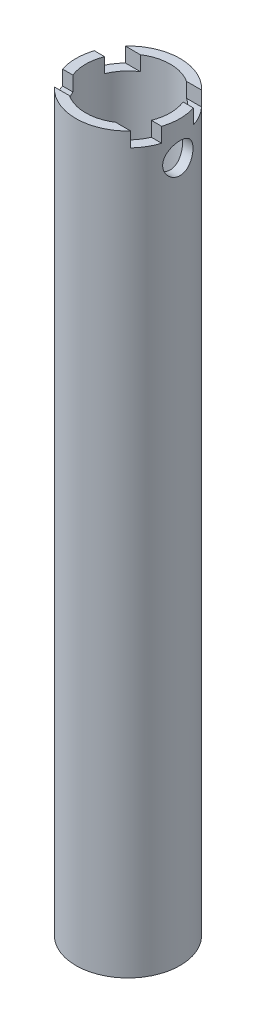
ISO-10303-21;
HEADER;
FILE_DESCRIPTION(('STEP AP214'),'2;1');
FILE_NAME('part.step','',(''),(''),'','','');
FILE_SCHEMA(('AUTOMOTIVE_DESIGN { 1 0 10303 214 1 1 1 1 }'));
ENDSEC;
DATA;
#1=APPLICATION_CONTEXT('core data for automotive mechanical design processes');
#2=APPLICATION_PROTOCOL_DEFINITION('international standard','automotive_design',2000,#1);
#3=PRODUCT_CONTEXT('',#1,'mechanical');
#4=PRODUCT('Part','Part','',(#3));
#5=PRODUCT_RELATED_PRODUCT_CATEGORY('part','',(#4));
#6=PRODUCT_DEFINITION_FORMATION('','',#4);
#7=PRODUCT_DEFINITION_CONTEXT('part definition',#1,'design');
#8=PRODUCT_DEFINITION('design','',#6,#7);
#9=PRODUCT_DEFINITION_SHAPE('','',#8);
#10=(LENGTH_UNIT() NAMED_UNIT(*) SI_UNIT(.MILLI.,.METRE.));
#11=(NAMED_UNIT(*) PLANE_ANGLE_UNIT() SI_UNIT($,.RADIAN.));
#12=(NAMED_UNIT(*) SI_UNIT($,.STERADIAN.) SOLID_ANGLE_UNIT());
#13=UNCERTAINTY_MEASURE_WITH_UNIT(LENGTH_MEASURE(1.E-05),#10,'distance_accuracy_value','');
#14=(GEOMETRIC_REPRESENTATION_CONTEXT(3) GLOBAL_UNCERTAINTY_ASSIGNED_CONTEXT((#13)) GLOBAL_UNIT_ASSIGNED_CONTEXT((#10,
#11,#12)) REPRESENTATION_CONTEXT('',''));
#15=CARTESIAN_POINT('',(0.,0.,0.));
#16=DIRECTION('',(0.,0.,1.));
#17=DIRECTION('',(1.,0.,0.));
#18=AXIS2_PLACEMENT_3D('',#15,#16,#17);
#19=CARTESIAN_POINT('',(0.,0.,0.));
#20=DIRECTION('',(0.,1.,0.));
#21=DIRECTION('',(0.,0.,1.));
#22=AXIS2_PLACEMENT_3D('',#19,#20,#21);
#23=PLANE('',#22);
#24=CARTESIAN_POINT('',(0.,0.,0.));
#25=DIRECTION('',(0.,1.,0.));
#26=DIRECTION('',(0.,0.,1.));
#27=AXIS2_PLACEMENT_3D('',#24,#25,#26);
#28=CIRCLE('',#27,10.65);
#29=CARTESIAN_POINT('',(10.1419919148065,0.,3.25));
#30=VERTEX_POINT('',#29);
#31=CARTESIAN_POINT('',(10.1419919148065,0.,-3.25));
#32=VERTEX_POINT('',#31);
#33=EDGE_CURVE('E289',#30,#32,#28,.T.);
#34=ORIENTED_EDGE('',*,*,#33,.T.);
#35=DIRECTION('',(-1.,0.,0.));
#36=VECTOR('',#35,1.);
#37=CARTESIAN_POINT('',(0.,0.,-3.25));
#38=LINE('',#37,#36);
#39=CARTESIAN_POINT('',(8.01623352953244,0.,-3.25));
#40=VERTEX_POINT('',#39);
#41=EDGE_CURVE('E160',#32,#40,#38,.T.);
#42=ORIENTED_EDGE('',*,*,#41,.T.);
#43=CARTESIAN_POINT('',(0.,0.,0.));
#44=DIRECTION('',(0.,1.,0.));
#45=DIRECTION('',(0.,0.,1.));
#46=AXIS2_PLACEMENT_3D('',#43,#44,#45);
#47=CIRCLE('',#46,8.65);
#48=CARTESIAN_POINT('',(8.01623352953244,0.,3.25));
#49=VERTEX_POINT('',#48);
#50=EDGE_CURVE('E284',#49,#40,#47,.T.);
#51=ORIENTED_EDGE('',*,*,#50,.F.);
#52=DIRECTION('',(1.,0.,0.));
#53=VECTOR('',#52,1.);
#54=CARTESIAN_POINT('',(0.,0.,3.25));
#55=LINE('',#54,#53);
#56=EDGE_CURVE('E204',#49,#30,#55,.T.);
#57=ORIENTED_EDGE('',*,*,#56,.T.);
#58=EDGE_LOOP('',(#34,#42,#51,#57));
#59=FACE_BOUND('',#58,.T.);
#60=ADVANCED_FACE('F40',(#59),#23,.T.);
#61=CARTESIAN_POINT('',(-8.01623352953244,0.,-3.25));
#62=VERTEX_POINT('',#61);
#63=CARTESIAN_POINT('',(-8.01623352953244,0.,3.25));
#64=VERTEX_POINT('',#63);
#65=EDGE_CURVE('E285',#62,#64,#47,.T.);
#66=ORIENTED_EDGE('',*,*,#65,.F.);
#67=CARTESIAN_POINT('',(-10.1419919148065,0.,-3.25));
#68=VERTEX_POINT('',#67);
#69=EDGE_CURVE('E176',#62,#68,#38,.T.);
#70=ORIENTED_EDGE('',*,*,#69,.T.);
#71=CARTESIAN_POINT('',(-10.1419919148065,0.,3.25));
#72=VERTEX_POINT('',#71);
#73=EDGE_CURVE('E174',#68,#72,#28,.T.);
#74=ORIENTED_EDGE('',*,*,#73,.T.);
#75=EDGE_CURVE('E200',#72,#64,#55,.T.);
#76=ORIENTED_EDGE('',*,*,#75,.T.);
#77=EDGE_LOOP('',(#66,#70,#74,#76));
#78=FACE_BOUND('',#77,.T.);
#79=ADVANCED_FACE('F317',(#78),#23,.T.);
#80=DIRECTION('',(-1.,0.,0.));
#81=VECTOR('',#80,1.);
#82=CARTESIAN_POINT('',(0.,0.,-7.25));
#83=LINE('',#82,#81);
#84=CARTESIAN_POINT('',(7.80128194593683,0.,-7.25));
#85=VERTEX_POINT('',#84);
#86=CARTESIAN_POINT('',(4.71805044483418,0.,-7.25));
#87=VERTEX_POINT('',#86);
#88=EDGE_CURVE('E175',#85,#87,#83,.T.);
#89=ORIENTED_EDGE('',*,*,#88,.F.);
#90=CARTESIAN_POINT('',(-7.80128194593683,0.,-7.25));
#91=VERTEX_POINT('',#90);
#92=EDGE_CURVE('E293',#85,#91,#28,.T.);
#93=ORIENTED_EDGE('',*,*,#92,.T.);
#94=CARTESIAN_POINT('',(-4.71805044483418,0.,-7.25));
#95=VERTEX_POINT('',#94);
#96=EDGE_CURVE('E180',#95,#91,#83,.T.);
#97=ORIENTED_EDGE('',*,*,#96,.F.);
#98=EDGE_CURVE('E280',#87,#95,#47,.T.);
#99=ORIENTED_EDGE('',*,*,#98,.F.);
#100=EDGE_LOOP('',(#89,#93,#97,#99));
#101=FACE_BOUND('',#100,.T.);
#102=ADVANCED_FACE('F315',(#101),#23,.T.);
#103=CARTESIAN_POINT('',(0.,-150.,0.));
#104=DIRECTION('',(0.,1.,0.));
#105=DIRECTION('',(0.,0.,1.));
#106=AXIS2_PLACEMENT_3D('',#103,#104,#105);
#107=CYLINDRICAL_SURFACE('',#106,10.65);
#108=DIRECTION('',(0.,1.,0.));
#109=VECTOR('',#108,1.);
#110=CARTESIAN_POINT('',(-7.80128194593683,-150.,-7.25));
#111=LINE('',#110,#109);
#112=CARTESIAN_POINT('',(-7.80128194593683,-3.,-7.25));
#113=VERTEX_POINT('',#112);
#114=EDGE_CURVE('E186',#91,#113,#111,.F.);
#115=ORIENTED_EDGE('',*,*,#114,.F.);
#116=ORIENTED_EDGE('',*,*,#92,.F.);
#117=DIRECTION('',(0.,1.,0.));
#118=VECTOR('',#117,1.);
#119=CARTESIAN_POINT('',(7.80128194593683,-150.,-7.25));
#120=LINE('',#119,#118);
#121=CARTESIAN_POINT('',(7.80128194593683,-3.,-7.25));
#122=VERTEX_POINT('',#121);
#123=EDGE_CURVE('E178',#122,#85,#120,.T.);
#124=ORIENTED_EDGE('',*,*,#123,.F.);
#125=CARTESIAN_POINT('',(0.,-3.,0.));
#126=DIRECTION('',(0.,1.,0.));
#127=DIRECTION('',(0.,0.,1.));
#128=AXIS2_PLACEMENT_3D('',#125,#126,#127);
#129=CIRCLE('',#128,10.65);
#130=CARTESIAN_POINT('',(10.1419919148065,-3.,-3.25));
#131=VERTEX_POINT('',#130);
#132=EDGE_CURVE('E161',#122,#131,#129,.F.);
#133=ORIENTED_EDGE('',*,*,#132,.T.);
#134=DIRECTION('',(0.,1.,0.));
#135=VECTOR('',#134,1.);
#136=CARTESIAN_POINT('',(10.1419919148065,-150.,-3.25));
#137=LINE('',#136,#135);
#138=EDGE_CURVE('E181',#131,#32,#137,.T.);
#139=ORIENTED_EDGE('',*,*,#138,.T.);
#140=ORIENTED_EDGE('',*,*,#33,.F.);
#141=DIRECTION('',(0.,1.,0.));
#142=VECTOR('',#141,1.);
#143=CARTESIAN_POINT('',(10.1419919148065,-150.,3.25));
#144=LINE('',#143,#142);
#145=CARTESIAN_POINT('',(10.1419919148065,-3.,3.25));
#146=VERTEX_POINT('',#145);
#147=EDGE_CURVE('E206',#30,#146,#144,.F.);
#148=ORIENTED_EDGE('',*,*,#147,.T.);
#149=CARTESIAN_POINT('',(0.,-3.,0.));
#150=DIRECTION('',(0.,1.,0.));
#151=DIRECTION('',(0.,0.,1.));
#152=AXIS2_PLACEMENT_3D('',#149,#150,#151);
#153=CIRCLE('',#152,10.65);
#154=CARTESIAN_POINT('',(7.80128194593683,-3.,7.25));
#155=VERTEX_POINT('',#154);
#156=EDGE_CURVE('E196',#146,#155,#153,.F.);
#157=ORIENTED_EDGE('',*,*,#156,.T.);
#158=DIRECTION('',(0.,1.,0.));
#159=VECTOR('',#158,1.);
#160=CARTESIAN_POINT('',(7.80128194593683,-150.,7.25));
#161=LINE('',#160,#159);
#162=CARTESIAN_POINT('',(7.80128194593683,0.,7.25));
#163=VERTEX_POINT('',#162);
#164=EDGE_CURVE('E214',#163,#155,#161,.F.);
#165=ORIENTED_EDGE('',*,*,#164,.F.);
#166=CARTESIAN_POINT('',(-7.80128194593683,0.,7.25));
#167=VERTEX_POINT('',#166);
#168=EDGE_CURVE('E247',#167,#163,#28,.T.);
#169=ORIENTED_EDGE('',*,*,#168,.F.);
#170=DIRECTION('',(0.,1.,0.));
#171=VECTOR('',#170,1.);
#172=CARTESIAN_POINT('',(-7.80128194593683,-150.,7.25));
#173=LINE('',#172,#171);
#174=CARTESIAN_POINT('',(-7.80128194593683,-3.,7.25));
#175=VERTEX_POINT('',#174);
#176=EDGE_CURVE('E211',#175,#167,#173,.T.);
#177=ORIENTED_EDGE('',*,*,#176,.F.);
#178=CARTESIAN_POINT('',(-10.1419919148065,-3.,3.25));
#179=VERTEX_POINT('',#178);
#180=EDGE_CURVE('E199',#175,#179,#153,.F.);
#181=ORIENTED_EDGE('',*,*,#180,.T.);
#182=DIRECTION('',(0.,1.,0.));
#183=VECTOR('',#182,1.);
#184=CARTESIAN_POINT('',(-10.1419919148065,-150.,3.25));
#185=LINE('',#184,#183);
#186=EDGE_CURVE('E203',#179,#72,#185,.T.);
#187=ORIENTED_EDGE('',*,*,#186,.T.);
#188=ORIENTED_EDGE('',*,*,#73,.F.);
#189=DIRECTION('',(0.,1.,0.));
#190=VECTOR('',#189,1.);
#191=CARTESIAN_POINT('',(-10.1419919148065,-150.,-3.25));
#192=LINE('',#191,#190);
#193=CARTESIAN_POINT('',(-10.1419919148065,-3.,-3.25));
#194=VERTEX_POINT('',#193);
#195=EDGE_CURVE('E165',#68,#194,#192,.F.);
#196=ORIENTED_EDGE('',*,*,#195,.T.);
#197=EDGE_CURVE('E153',#194,#113,#129,.F.);
#198=ORIENTED_EDGE('',*,*,#197,.T.);
#199=EDGE_LOOP('',(#115,#116,#124,#133,#139,#140,#148,#157,#165,#169,#177,#181,#187,#188,#196,#198));
#200=FACE_BOUND('',#199,.T.);
#201=CARTESIAN_POINT('',(10.1888419361574,-7.,-3.1));
#202=CARTESIAN_POINT('',(10.1888441057503,-6.82987835471398,-3.09999727152298));
#203=CARTESIAN_POINT('',(10.1931493007926,-6.65972941708513,-3.08594844823669));
#204=CARTESIAN_POINT('',(10.2098410434388,-6.32438918117467,-3.03025830053538));
#205=CARTESIAN_POINT('',(10.2222306584506,-6.15919978954915,-2.98860650284716));
#206=CARTESIAN_POINT('',(10.25357172788,-5.83868050258358,-2.87923098039983));
#207=CARTESIAN_POINT('',(10.2725127392617,-5.68333537881959,-2.81154872951785));
#208=CARTESIAN_POINT('',(10.3148085299741,-5.38617028604735,-2.65216822465537));
#209=CARTESIAN_POINT('',(10.3381638845888,-5.24435208351645,-2.5604668398636));
#210=CARTESIAN_POINT('',(10.3874370057661,-4.97404162055039,-2.35272705808078));
#211=CARTESIAN_POINT('',(10.4134068954617,-4.84601196689376,-2.23609894723779));
#212=CARTESIAN_POINT('',(10.4645364221232,-4.61102455351764,-1.98308140257185));
#213=CARTESIAN_POINT('',(10.489695960539,-4.50406934871532,-1.84668957620989));
#214=CARTESIAN_POINT('',(10.5369591710148,-4.31228038081969,-1.55474845165297));
#215=CARTESIAN_POINT('',(10.5589942439578,-4.22791502560216,-1.39887935991856));
#216=CARTESIAN_POINT('',(10.5969222886104,-4.08677017969808,-1.07441716335687));
#217=CARTESIAN_POINT('',(10.612816503514,-4.02998510488672,-0.905826642205307));
#218=CARTESIAN_POINT('',(10.6363032535631,-3.94713425229078,-0.565544079407322));
#219=CARTESIAN_POINT('',(10.6441085813227,-3.9202795799392,-0.394059065436716));
#220=CARTESIAN_POINT('',(10.6512859901131,-3.89556082082881,-0.0488518243476302));
#221=CARTESIAN_POINT('',(10.6506597421006,-3.89769098989953,0.124869952675086));
#222=CARTESIAN_POINT('',(10.6411965128448,-3.93034465483563,0.46409708368491));
#223=CARTESIAN_POINT('',(10.6326064209459,-3.96001442086737,0.629692579767296));
#224=CARTESIAN_POINT('',(10.6084783016649,-4.04551477773604,0.953443488939181));
#225=CARTESIAN_POINT('',(10.5929398447781,-4.10134698578287,1.11159844143246));
#226=CARTESIAN_POINT('',(10.556312714695,-4.23818625085715,1.4180496868094));
#227=CARTESIAN_POINT('',(10.5351637973608,-4.31946840452005,1.56621564424446));
#228=CARTESIAN_POINT('',(10.4895690731987,-4.50468458581063,1.84708301522959));
#229=CARTESIAN_POINT('',(10.4651225218995,-4.60862373173712,1.97978092407758));
#230=CARTESIAN_POINT('',(10.4145085770061,-4.84066100978718,2.23104175007879));
#231=CARTESIAN_POINT('',(10.3883109340845,-4.96950042361061,2.34891489353613));
#232=CARTESIAN_POINT('',(10.3379318943086,-5.2453784722716,2.56156962710448));
#233=CARTESIAN_POINT('',(10.3137506743119,-5.39241870067223,2.65634919310942));
#234=CARTESIAN_POINT('',(10.2700037871355,-5.7022502200893,2.82078996550857));
#235=CARTESIAN_POINT('',(10.2504794060492,-5.86516557949654,2.89022918670249));
#236=CARTESIAN_POINT('',(10.2187517893602,-6.20107492991019,3.00049014503662));
#237=CARTESIAN_POINT('',(10.20654632904,-6.37406584071219,3.04132057896857));
#238=CARTESIAN_POINT('',(10.191322879948,-6.71868200797506,3.09194382708414));
#239=CARTESIAN_POINT('',(10.1879962663103,-6.89014053945853,3.1027797548745));
#240=CARTESIAN_POINT('',(10.1900562132623,-7.23242724952157,3.09600860569731));
#241=CARTESIAN_POINT('',(10.1954416384946,-7.40325550733097,3.07840523495467));
#242=CARTESIAN_POINT('',(10.2140172443717,-7.7351758871437,3.01618171783668));
#243=CARTESIAN_POINT('',(10.2270168373842,-7.89640331192945,2.97222070620975));
#244=CARTESIAN_POINT('',(10.2591617076393,-8.20918718798164,2.85928755922712));
#245=CARTESIAN_POINT('',(10.2783078950711,-8.36074220296846,2.79031171947375));
#246=CARTESIAN_POINT('',(10.3211967948522,-8.65415553097118,2.62729011881327));
#247=CARTESIAN_POINT('',(10.3450443733836,-8.79566752569532,2.53264930365096));
#248=CARTESIAN_POINT('',(10.3944179860008,-9.06118338777822,2.32169936910348));
#249=CARTESIAN_POINT('',(10.419944397114,-9.18518330250806,2.2053853715892));
#250=CARTESIAN_POINT('',(10.4708879331935,-9.41665245937621,1.94950844514348));
#251=CARTESIAN_POINT('',(10.4962695262011,-9.52338542798524,1.80927082274462));
#252=CARTESIAN_POINT('',(10.5431532711981,-9.71181386531733,1.51227826770432));
#253=CARTESIAN_POINT('',(10.5646556229435,-9.79351062339549,1.355524186213));
#254=CARTESIAN_POINT('',(10.6012229511761,-9.92876303130464,1.03101854405395));
#255=CARTESIAN_POINT('',(10.6163363619921,-9.98253114645553,0.863361268630194));
#256=CARTESIAN_POINT('',(10.6386369079939,-10.0609685591747,0.520875459021169));
#257=CARTESIAN_POINT('',(10.6458261663449,-10.0856456513969,0.346048858783191));
#258=CARTESIAN_POINT('',(10.6513470969274,-10.1046362283856,0.00101089861311552));
#259=CARTESIAN_POINT('',(10.6499911849361,-10.1000206245671,-0.169137279447993));
#260=CARTESIAN_POINT('',(10.6393021777788,-10.0630964344509,-0.506131642647187));
#261=CARTESIAN_POINT('',(10.6299694901495,-10.0307892629257,-0.672977996031203));
#262=CARTESIAN_POINT('',(10.604457460481,-9.94004723158736,-0.997086068952581));
#263=CARTESIAN_POINT('',(10.5883446248182,-9.88186586432684,-1.15442435027252));
#264=CARTESIAN_POINT('',(10.5509425806665,-9.7412528029522,-1.45719132923713));
#265=CARTESIAN_POINT('',(10.5296525515813,-9.65881726406367,-1.602618133997));
#266=CARTESIAN_POINT('',(10.483333940895,-9.46910706227823,-1.88226608877159));
#267=CARTESIAN_POINT('',(10.4582109129596,-9.36114965976719,-2.01600832446907));
#268=CARTESIAN_POINT('',(10.4073807615634,-9.12470766237661,-2.2638379450713));
#269=CARTESIAN_POINT('',(10.381673475975,-8.99621730858273,-2.37791979707959));
#270=CARTESIAN_POINT('',(10.3317560790232,-8.71810309580794,-2.5863370424073));
#271=CARTESIAN_POINT('',(10.3076067635984,-8.56799435534128,-2.68004150275658));
#272=CARTESIAN_POINT('',(10.2644780911802,-8.25347252445207,-2.84076683294284));
#273=CARTESIAN_POINT('',(10.2454959914046,-8.08906708417627,-2.90780186779073));
#274=CARTESIAN_POINT('',(10.2169437838262,-7.77154285546914,-3.00646943360063));
#275=CARTESIAN_POINT('',(10.2065010177036,-7.61953645903448,-3.04145092896509));
#276=CARTESIAN_POINT('',(10.1924496902661,-7.31169390015436,-3.0882154584601));
#277=CARTESIAN_POINT('',(10.1888399484663,-7.15585840394384,-3.10000249971762));
#278=CARTESIAN_POINT('',(10.1888419361574,-7.,-3.1));
#279=B_SPLINE_CURVE_WITH_KNOTS('',3,(#201,#202,#203,#204,#205,#206,#207,#208,#209,#210,#211,
#212,#213,#214,#215,#216,#217,#218,#219,#220,#221,#222,#223,#224,#225,#226,#227,#228,#229,#230,
#231,#232,#233,#234,#235,#236,#237,#238,#239,#240,#241,#242,#243,#244,#245,#246,#247,#248,#249,
#250,#251,#252,#253,#254,#255,#256,#257,#258,#259,#260,#261,#262,#263,#264,#265,#266,#267,#268,
#269,#270,#271,#272,#273,#274,#275,#276,#277,#278),.UNSPECIFIED.,.T.,.F.,(4,2,2,2,2,2,2,2,2,2,2,
2,2,2,2,2,2,2,2,2,2,2,2,2,2,2,2,2,2,2,2,2,2,2,2,2,2,2,4),(0.,0.50979052428436,1.01977458693838,
1.5289494445066,2.03819070431847,2.56116742129301,3.08420750131008,3.61737461167768,
4.15043372770851,4.669083478286,5.18763044516546,5.69062076890831,6.19364218868785,
6.70230043234714,7.21107370309876,7.73835435822127,8.26568121183146,8.79752251972448,
9.32920208283187,9.84214424855111,10.3550195727591,10.8555749809802,11.3562045457754,
11.8696146328054,12.3831404163915,12.9147576133443,13.4463474276157,13.9738316882777,
14.5011745825673,15.0093522416927,15.5175039393781,16.0207832831433,16.5241424498381,
17.0429006374553,17.5618045783221,18.0950108927676,18.6279336244642,19.095063293686,
19.5621122534293),.UNSPECIFIED.);
#280=CARTESIAN_POINT('',(10.1888419361574,-7.,-3.1));
#281=VERTEX_POINT('',#280);
#282=EDGE_CURVE('E217',#281,#281,#279,.T.);
#283=ORIENTED_EDGE('',*,*,#282,.F.);
#284=EDGE_LOOP('',(#283));
#285=FACE_BOUND('',#284,.T.);
#286=CARTESIAN_POINT('',(0.,-150.,0.));
#287=DIRECTION('',(0.,1.,0.));
#288=DIRECTION('',(0.,0.,1.));
#289=AXIS2_PLACEMENT_3D('',#286,#287,#288);
#290=CIRCLE('',#289,10.65);
#291=CARTESIAN_POINT('',(0.,-150.,10.65));
#292=VERTEX_POINT('',#291);
#293=EDGE_CURVE('E252',#292,#292,#290,.T.);
#294=ORIENTED_EDGE('',*,*,#293,.T.);
#295=EDGE_LOOP('',(#294));
#296=FACE_BOUND('',#295,.T.);
#297=ADVANCED_FACE('F42',(#200,#285,#296),#107,.T.);
#298=CARTESIAN_POINT('',(0.,-150.,0.));
#299=DIRECTION('',(0.,1.,0.));
#300=DIRECTION('',(0.,0.,1.));
#301=AXIS2_PLACEMENT_3D('',#298,#299,#300);
#302=PLANE('',#301);
#303=CARTESIAN_POINT('',(0.,-150.,0.));
#304=DIRECTION('',(0.,1.,0.));
#305=DIRECTION('',(0.,0.,1.));
#306=AXIS2_PLACEMENT_3D('',#303,#304,#305);
#307=CIRCLE('',#306,8.65);
#308=CARTESIAN_POINT('',(0.,-150.,8.65));
#309=VERTEX_POINT('',#308);
#310=EDGE_CURVE('E225',#309,#309,#307,.T.);
#311=ORIENTED_EDGE('',*,*,#310,.T.);
#312=EDGE_LOOP('',(#311));
#313=FACE_BOUND('',#312,.T.);
#314=ORIENTED_EDGE('',*,*,#293,.F.);
#315=EDGE_LOOP('',(#314));
#316=FACE_BOUND('',#315,.T.);
#317=ADVANCED_FACE('F307',(#313,#316),#302,.F.);
#318=DIRECTION('',(1.,0.,0.));
#319=VECTOR('',#318,1.);
#320=CARTESIAN_POINT('',(0.,0.,7.25));
#321=LINE('',#320,#319);
#322=CARTESIAN_POINT('',(-4.71805044483418,0.,7.25));
#323=VERTEX_POINT('',#322);
#324=EDGE_CURVE('E209',#167,#323,#321,.T.);
#325=ORIENTED_EDGE('',*,*,#324,.F.);
#326=ORIENTED_EDGE('',*,*,#168,.T.);
#327=CARTESIAN_POINT('',(4.71805044483418,0.,7.25));
#328=VERTEX_POINT('',#327);
#329=EDGE_CURVE('E212',#328,#163,#321,.T.);
#330=ORIENTED_EDGE('',*,*,#329,.F.);
#331=EDGE_CURVE('E224',#323,#328,#47,.T.);
#332=ORIENTED_EDGE('',*,*,#331,.F.);
#333=EDGE_LOOP('',(#325,#326,#330,#332));
#334=FACE_BOUND('',#333,.T.);
#335=ADVANCED_FACE('F311',(#334),#23,.T.);
#336=CARTESIAN_POINT('',(0.,-150.,0.));
#337=DIRECTION('',(0.,1.,0.));
#338=DIRECTION('',(0.,0.,1.));
#339=AXIS2_PLACEMENT_3D('',#336,#337,#338);
#340=CYLINDRICAL_SURFACE('',#339,8.65);
#341=ORIENTED_EDGE('',*,*,#98,.T.);
#342=DIRECTION('',(0.,1.,0.));
#343=VECTOR('',#342,1.);
#344=CARTESIAN_POINT('',(-4.71805044483418,-150.,-7.25));
#345=LINE('',#344,#343);
#346=CARTESIAN_POINT('',(-4.71805044483418,-3.,-7.25));
#347=VERTEX_POINT('',#346);
#348=EDGE_CURVE('E12',#95,#347,#345,.F.);
#349=ORIENTED_EDGE('',*,*,#348,.T.);
#350=CARTESIAN_POINT('',(0.,-3.,0.));
#351=DIRECTION('',(0.,1.,0.));
#352=DIRECTION('',(0.,0.,1.));
#353=AXIS2_PLACEMENT_3D('',#350,#351,#352);
#354=CIRCLE('',#353,8.65);
#355=CARTESIAN_POINT('',(-8.01623352953244,-3.,-3.25));
#356=VERTEX_POINT('',#355);
#357=EDGE_CURVE('E268',#356,#347,#354,.F.);
#358=ORIENTED_EDGE('',*,*,#357,.F.);
#359=DIRECTION('',(0.,1.,0.));
#360=VECTOR('',#359,1.);
#361=CARTESIAN_POINT('',(-8.01623352953244,-150.,-3.25));
#362=LINE('',#361,#360);
#363=EDGE_CURVE('E49',#62,#356,#362,.F.);
#364=ORIENTED_EDGE('',*,*,#363,.F.);
#365=ORIENTED_EDGE('',*,*,#65,.T.);
#366=DIRECTION('',(0.,1.,0.));
#367=VECTOR('',#366,1.);
#368=CARTESIAN_POINT('',(-8.01623352953244,-150.,3.25));
#369=LINE('',#368,#367);
#370=CARTESIAN_POINT('',(-8.01623352953244,-3.,3.25));
#371=VERTEX_POINT('',#370);
#372=EDGE_CURVE('E259',#371,#64,#369,.T.);
#373=ORIENTED_EDGE('',*,*,#372,.F.);
#374=CARTESIAN_POINT('',(0.,-3.,0.));
#375=DIRECTION('',(0.,1.,0.));
#376=DIRECTION('',(0.,0.,1.));
#377=AXIS2_PLACEMENT_3D('',#374,#375,#376);
#378=CIRCLE('',#377,8.65);
#379=CARTESIAN_POINT('',(-4.71805044483418,-3.,7.25));
#380=VERTEX_POINT('',#379);
#381=EDGE_CURVE('E253',#380,#371,#378,.F.);
#382=ORIENTED_EDGE('',*,*,#381,.F.);
#383=DIRECTION('',(0.,1.,0.));
#384=VECTOR('',#383,1.);
#385=CARTESIAN_POINT('',(-4.71805044483418,-150.,7.25));
#386=LINE('',#385,#384);
#387=EDGE_CURVE('E262',#380,#323,#386,.T.);
#388=ORIENTED_EDGE('',*,*,#387,.T.);
#389=ORIENTED_EDGE('',*,*,#331,.T.);
#390=DIRECTION('',(0.,1.,0.));
#391=VECTOR('',#390,1.);
#392=CARTESIAN_POINT('',(4.71805044483418,-150.,7.25));
#393=LINE('',#392,#391);
#394=CARTESIAN_POINT('',(4.71805044483418,-3.,7.25));
#395=VERTEX_POINT('',#394);
#396=EDGE_CURVE('E256',#328,#395,#393,.F.);
#397=ORIENTED_EDGE('',*,*,#396,.T.);
#398=CARTESIAN_POINT('',(8.01623352953244,-3.,3.25));
#399=VERTEX_POINT('',#398);
#400=EDGE_CURVE('E249',#399,#395,#378,.F.);
#401=ORIENTED_EDGE('',*,*,#400,.F.);
#402=DIRECTION('',(0.,1.,0.));
#403=VECTOR('',#402,1.);
#404=CARTESIAN_POINT('',(8.01623352953244,-150.,3.25));
#405=LINE('',#404,#403);
#406=EDGE_CURVE('E251',#49,#399,#405,.F.);
#407=ORIENTED_EDGE('',*,*,#406,.F.);
#408=ORIENTED_EDGE('',*,*,#50,.T.);
#409=DIRECTION('',(0.,1.,0.));
#410=VECTOR('',#409,1.);
#411=CARTESIAN_POINT('',(8.01623352953244,-150.,-3.25));
#412=LINE('',#411,#410);
#413=CARTESIAN_POINT('',(8.01623352953244,-3.,-3.25));
#414=VERTEX_POINT('',#413);
#415=EDGE_CURVE('E267',#414,#40,#412,.T.);
#416=ORIENTED_EDGE('',*,*,#415,.F.);
#417=CARTESIAN_POINT('',(4.71805044483418,-3.,-7.25));
#418=VERTEX_POINT('',#417);
#419=EDGE_CURVE('E265',#418,#414,#354,.F.);
#420=ORIENTED_EDGE('',*,*,#419,.F.);
#421=DIRECTION('',(0.,1.,0.));
#422=VECTOR('',#421,1.);
#423=CARTESIAN_POINT('',(4.71805044483418,-150.,-7.25));
#424=LINE('',#423,#422);
#425=EDGE_CURVE('E270',#418,#87,#424,.T.);
#426=ORIENTED_EDGE('',*,*,#425,.T.);
#427=EDGE_LOOP('',(#341,#349,#358,#364,#365,#373,#382,#388,#389,#397,#401,#407,#408,#416,#420,#426));
#428=FACE_BOUND('',#427,.T.);
#429=CARTESIAN_POINT('',(8.07542568537412,-7.,-3.1));
#430=CARTESIAN_POINT('',(8.07542233782002,-6.83198959456713,-3.10000380313353));
#431=CARTESIAN_POINT('',(8.08072602099948,-6.66400541447108,-3.08629575774146));
#432=CARTESIAN_POINT('',(8.10123510078386,-6.33306599972194,-3.03204831985805));
#433=CARTESIAN_POINT('',(8.11644092955894,-6.17011098488732,-2.99150775628458));
#434=CARTESIAN_POINT('',(8.15481539820621,-5.85408984051061,-2.88524455098353));
#435=CARTESIAN_POINT('',(8.17796640926718,-5.70100270182905,-2.81957762299872));
#436=CARTESIAN_POINT('',(8.22959546746569,-5.40796171327764,-2.66512047772629));
#437=CARTESIAN_POINT('',(8.25807495435342,-5.26801142835973,-2.57632400830463));
#438=CARTESIAN_POINT('',(8.31859874209237,-4.99887448520454,-2.37381793375204));
#439=CARTESIAN_POINT('',(8.35074155191664,-4.87036849539607,-2.25923291054817));
#440=CARTESIAN_POINT('',(8.41414419149071,-4.63392310673716,-2.01026424998966));
#441=CARTESIAN_POINT('',(8.44540385216568,-4.52598762359219,-1.87587685176321));
#442=CARTESIAN_POINT('',(8.50467642422263,-4.33054754109322,-1.5860296231461));
#443=CARTESIAN_POINT('',(8.53256021372728,-4.24377181814437,-1.43004956569979));
#444=CARTESIAN_POINT('',(8.58076493943372,-4.09796892883706,-1.1045317098825));
#445=CARTESIAN_POINT('',(8.6010882546175,-4.03893303231239,-0.934998196681555));
#446=CARTESIAN_POINT('',(8.63118353487815,-3.95264010048989,-0.594334122906921));
#447=CARTESIAN_POINT('',(8.64134264389183,-3.9242136212207,-0.423534648443659));
#448=CARTESIAN_POINT('',(8.65134799401296,-3.89621119190994,-0.0793077938822485));
#449=CARTESIAN_POINT('',(8.65119729986184,-3.89662666817114,0.0941187899426907));
#450=CARTESIAN_POINT('',(8.64085295369663,-3.92559022189375,0.430338167573701));
#451=CARTESIAN_POINT('',(8.63111402715771,-3.95286452385534,0.593257052157645));
#452=CARTESIAN_POINT('',(8.6032733986702,-4.03264381517383,0.912030316167054));
#453=CARTESIAN_POINT('',(8.58517111209876,-4.08515056836172,1.06788420089229));
#454=CARTESIAN_POINT('',(8.5420976334551,-4.21455689232964,1.37069540755739));
#455=CARTESIAN_POINT('',(8.5170334204387,-4.29178912804415,1.51749678675591));
#456=CARTESIAN_POINT('',(8.46260268287722,-4.46816867821915,1.79640692628605));
#457=CARTESIAN_POINT('',(8.43323484262627,-4.56732269934535,1.92851117160132));
#458=CARTESIAN_POINT('',(8.37138539433572,-4.79098673794026,2.18181567077155));
#459=CARTESIAN_POINT('',(8.33882127228128,-4.916574899927,2.30204523221957));
#460=CARTESIAN_POINT('',(8.2755427454282,-5.18636316813067,2.520081715627));
#461=CARTESIAN_POINT('',(8.24482872681689,-5.33056714056994,2.61788396802608));
#462=CARTESIAN_POINT('',(8.18823511923222,-5.63700917998839,2.78992673901901));
#463=CARTESIAN_POINT('',(8.16245681844251,-5.79953436188777,2.86369179779753));
#464=CARTESIAN_POINT('',(8.11982135049482,-6.13586338702395,2.98245373407905));
#465=CARTESIAN_POINT('',(8.10295973343434,-6.30966155572615,3.02746496361951));
#466=CARTESIAN_POINT('',(8.08109859907995,-6.65408278375662,3.08532963635387));
#467=CARTESIAN_POINT('',(8.07553633138493,-6.82441336578721,3.09971051103132));
#468=CARTESIAN_POINT('',(8.07531843842961,-7.16510782508341,3.1002806341983));
#469=CARTESIAN_POINT('',(8.08066041330784,-7.33547168677342,3.0864760858797));
#470=CARTESIAN_POINT('',(8.10108171969688,-7.6639393738002,3.03244752745281));
#471=CARTESIAN_POINT('',(8.11574414130696,-7.82225789362762,2.99335347253063));
#472=CARTESIAN_POINT('',(8.15267441413555,-8.13003365109962,2.89124997455237));
#473=CARTESIAN_POINT('',(8.17494374009011,-8.27948916389123,2.82823589390268));
#474=CARTESIAN_POINT('',(8.22554724175769,-8.57114784136929,2.67757025631734));
#475=CARTESIAN_POINT('',(8.2540675658627,-8.7129095205052,2.58912837690864));
#476=CARTESIAN_POINT('',(8.31362737910438,-8.98012660335563,2.39098047728874));
#477=CARTESIAN_POINT('',(8.34466771686225,-9.10557647671815,2.2812672764948));
#478=CARTESIAN_POINT('',(8.40790834675693,-9.34401310049569,2.03628306446398));
#479=CARTESIAN_POINT('',(8.44007395687062,-9.45588243610479,1.89991199415683));
#480=CARTESIAN_POINT('',(8.50022573841191,-9.65525772678507,1.60953899364014));
#481=CARTESIAN_POINT('',(8.52821197462918,-9.74276405955563,1.45553733680965));
#482=CARTESIAN_POINT('',(8.57677887971909,-9.89023798929713,1.13469216034847));
#483=CARTESIAN_POINT('',(8.59739608024931,-9.95034185369241,0.967917110924003));
#484=CARTESIAN_POINT('',(8.6290458331891,-10.0413441335022,0.625726217172641));
#485=CARTESIAN_POINT('',(8.6400824531192,-10.0722549435779,0.450314073259353));
#486=CARTESIAN_POINT('',(8.65097390906914,-10.1027456213503,0.105975072210067));
#487=CARTESIAN_POINT('',(8.65139751766496,-10.1039192072649,-0.0627940412719361));
#488=CARTESIAN_POINT('',(8.64246424170819,-10.0789324448114,-0.398015517935068));
#489=CARTESIAN_POINT('',(8.63310836957004,-10.0527749258784,-0.564468119124137));
#490=CARTESIAN_POINT('',(8.60590748707151,-9.97496669414953,-0.886856214524017));
#491=CARTESIAN_POINT('',(8.58824227083488,-9.92385507853587,-1.04293811410244));
#492=CARTESIAN_POINT('',(8.5462515472123,-9.79810947867279,-1.34434519784151));
#493=CARTESIAN_POINT('',(8.52192479051414,-9.7234710817893,-1.48966835779616));
#494=CARTESIAN_POINT('',(8.46785849191843,-9.5493598145447,-1.77181860050029));
#495=CARTESIAN_POINT('',(8.43794068140346,-9.44900928418986,-1.90806936491389));
#496=CARTESIAN_POINT('',(8.37640055614901,-9.22774934156927,-2.16230270267295));
#497=CARTESIAN_POINT('',(8.34477765949265,-9.10683287977963,-2.28027898536621));
#498=CARTESIAN_POINT('',(8.28158767301326,-8.84108511779239,-2.50030731345727));
#499=CARTESIAN_POINT('',(8.25009338311968,-8.69539559309408,-2.60134743933056));
#500=CARTESIAN_POINT('',(8.19247290413051,-8.38810665527686,-2.77750131159969));
#501=CARTESIAN_POINT('',(8.16634641253283,-8.22650813946819,-2.85261651915573));
#502=CARTESIAN_POINT('',(8.12267038186309,-7.89058150571383,-2.97472701199815));
#503=CARTESIAN_POINT('',(8.10518050562055,-7.71617414382481,-3.02152717958956));
#504=CARTESIAN_POINT('',(8.08156286267143,-7.36116561263297,-3.08415370670806));
#505=CARTESIAN_POINT('',(8.07542928312754,-7.18056766029178,-3.09999591261671));
#506=CARTESIAN_POINT('',(8.07542568537412,-7.,-3.1));
#507=B_SPLINE_CURVE_WITH_KNOTS('',3,(#429,#430,#431,#432,#433,#434,#435,#436,#437,#438,#439,
#440,#441,#442,#443,#444,#445,#446,#447,#448,#449,#450,#451,#452,#453,#454,#455,#456,#457,#458,
#459,#460,#461,#462,#463,#464,#465,#466,#467,#468,#469,#470,#471,#472,#473,#474,#475,#476,#477,
#478,#479,#480,#481,#482,#483,#484,#485,#486,#487,#488,#489,#490,#491,#492,#493,#494,#495,#496,
#497,#498,#499,#500,#501,#502,#503,#504,#505,#506),.UNSPECIFIED.,.T.,.F.,(4,2,2,2,2,2,2,2,2,2,2,
2,2,2,2,2,2,2,2,2,2,2,2,2,2,2,2,2,2,2,2,2,2,2,2,2,2,2,4),(0.,0.503360344799801,1.00674265977679,
1.50901521223586,2.01142367486991,2.53452347391774,3.05772274855812,3.59698269710109,
4.13607281807049,4.65374376652758,5.1712608303092,5.66536163246663,6.15949697891355,
6.66058162878324,7.16181979119669,7.69005827589503,8.21840664476878,8.75664783951948,
9.29462016900079,9.80506887583581,10.3154052526219,10.8043817735454,11.2934531452685,
11.7997679244514,12.3062539193842,12.8415988313657,13.3769354434382,13.9095800840287,
14.4419984748531,14.9458187028277,15.4495867783034,15.9429234457665,16.4363526975393,
16.9496160445171,17.4630556821373,18.0006815203627,18.5382770523864,19.0795361459095,
19.6205181137227),.UNSPECIFIED.);
#508=CARTESIAN_POINT('',(8.07542568537412,-7.,-3.1));
#509=VERTEX_POINT('',#508);
#510=EDGE_CURVE('E216',#509,#509,#507,.T.);
#511=ORIENTED_EDGE('',*,*,#510,.T.);
#512=EDGE_LOOP('',(#511));
#513=FACE_BOUND('',#512,.T.);
#514=ORIENTED_EDGE('',*,*,#310,.F.);
#515=EDGE_LOOP('',(#514));
#516=FACE_BOUND('',#515,.T.);
#517=ADVANCED_FACE('F233',(#428,#513,#516),#340,.F.);
#518=CARTESIAN_POINT('',(3.65000000000001,-7.,0.));
#519=DIRECTION('',(1.,0.,0.));
#520=DIRECTION('',(0.,0.,-1.));
#521=AXIS2_PLACEMENT_3D('',#518,#519,#520);
#522=CYLINDRICAL_SURFACE('',#521,3.1);
#523=ORIENTED_EDGE('',*,*,#282,.T.);
#524=EDGE_LOOP('',(#523));
#525=FACE_BOUND('',#524,.T.);
#526=ORIENTED_EDGE('',*,*,#510,.F.);
#527=EDGE_LOOP('',(#526));
#528=FACE_BOUND('',#527,.T.);
#529=ADVANCED_FACE('F227',(#525,#528),#522,.F.);
#530=CARTESIAN_POINT('',(10.65,-3.,7.25));
#531=DIRECTION('',(0.,1.,0.));
#532=DIRECTION('',(0.,0.,1.));
#533=AXIS2_PLACEMENT_3D('',#530,#531,#532);
#534=PLANE('',#533);
#535=DIRECTION('',(1.,0.,0.));
#536=VECTOR('',#535,1.);
#537=CARTESIAN_POINT('',(10.65,-3.,3.25));
#538=LINE('',#537,#536);
#539=EDGE_CURVE('E188',#399,#146,#538,.T.);
#540=ORIENTED_EDGE('',*,*,#539,.F.);
#541=ORIENTED_EDGE('',*,*,#400,.T.);
#542=DIRECTION('',(1.,0.,0.));
#543=VECTOR('',#542,1.);
#544=CARTESIAN_POINT('',(10.65,-3.,7.25));
#545=LINE('',#544,#543);
#546=EDGE_CURVE('E189',#395,#155,#545,.T.);
#547=ORIENTED_EDGE('',*,*,#546,.T.);
#548=ORIENTED_EDGE('',*,*,#156,.F.);
#549=EDGE_LOOP('',(#540,#541,#547,#548));
#550=FACE_BOUND('',#549,.T.);
#551=ADVANCED_FACE('F232',(#550),#534,.T.);
#552=CARTESIAN_POINT('',(-52.2585330504188,0.,3.25));
#553=DIRECTION('',(0.,0.,1.));
#554=DIRECTION('',(1.,0.,0.));
#555=AXIS2_PLACEMENT_3D('',#552,#553,#554);
#556=PLANE('',#555);
#557=ORIENTED_EDGE('',*,*,#56,.F.);
#558=ORIENTED_EDGE('',*,*,#406,.T.);
#559=ORIENTED_EDGE('',*,*,#539,.T.);
#560=ORIENTED_EDGE('',*,*,#147,.F.);
#561=EDGE_LOOP('',(#557,#558,#559,#560));
#562=FACE_BOUND('',#561,.T.);
#563=ADVANCED_FACE('F347',(#562),#556,.T.);
#564=CARTESIAN_POINT('',(-52.2585330504188,0.,7.25));
#565=DIRECTION('',(0.,0.,1.));
#566=DIRECTION('',(1.,0.,0.));
#567=AXIS2_PLACEMENT_3D('',#564,#565,#566);
#568=PLANE('',#567);
#569=ORIENTED_EDGE('',*,*,#164,.T.);
#570=ORIENTED_EDGE('',*,*,#546,.F.);
#571=ORIENTED_EDGE('',*,*,#396,.F.);
#572=ORIENTED_EDGE('',*,*,#329,.T.);
#573=EDGE_LOOP('',(#569,#570,#571,#572));
#574=FACE_BOUND('',#573,.T.);
#575=ADVANCED_FACE('F352',(#574),#568,.F.);
#576=EDGE_CURVE('E192',#175,#380,#545,.T.);
#577=ORIENTED_EDGE('',*,*,#576,.T.);
#578=ORIENTED_EDGE('',*,*,#381,.T.);
#579=EDGE_CURVE('E193',#179,#371,#538,.T.);
#580=ORIENTED_EDGE('',*,*,#579,.F.);
#581=ORIENTED_EDGE('',*,*,#180,.F.);
#582=EDGE_LOOP('',(#577,#578,#580,#581));
#583=FACE_BOUND('',#582,.T.);
#584=ADVANCED_FACE('F235',(#583),#534,.T.);
#585=ORIENTED_EDGE('',*,*,#176,.T.);
#586=ORIENTED_EDGE('',*,*,#324,.T.);
#587=ORIENTED_EDGE('',*,*,#387,.F.);
#588=ORIENTED_EDGE('',*,*,#576,.F.);
#589=EDGE_LOOP('',(#585,#586,#587,#588));
#590=FACE_BOUND('',#589,.T.);
#591=ADVANCED_FACE('F360',(#590),#568,.F.);
#592=ORIENTED_EDGE('',*,*,#579,.T.);
#593=ORIENTED_EDGE('',*,*,#372,.T.);
#594=ORIENTED_EDGE('',*,*,#75,.F.);
#595=ORIENTED_EDGE('',*,*,#186,.F.);
#596=EDGE_LOOP('',(#592,#593,#594,#595));
#597=FACE_BOUND('',#596,.T.);
#598=ADVANCED_FACE('F366',(#597),#556,.T.);
#599=CARTESIAN_POINT('',(10.65,-3.,-7.25));
#600=DIRECTION('',(0.,1.,0.));
#601=DIRECTION('',(0.,0.,-1.));
#602=AXIS2_PLACEMENT_3D('',#599,#600,#601);
#603=PLANE('',#602);
#604=DIRECTION('',(1.,0.,0.));
#605=VECTOR('',#604,1.);
#606=CARTESIAN_POINT('',(10.65,-3.,-7.25));
#607=LINE('',#606,#605);
#608=EDGE_CURVE('E64',#418,#122,#607,.T.);
#609=ORIENTED_EDGE('',*,*,#608,.F.);
#610=ORIENTED_EDGE('',*,*,#419,.T.);
#611=DIRECTION('',(1.,0.,0.));
#612=VECTOR('',#611,1.);
#613=CARTESIAN_POINT('',(10.65,-3.,-3.25));
#614=LINE('',#613,#612);
#615=EDGE_CURVE('E169',#414,#131,#614,.T.);
#616=ORIENTED_EDGE('',*,*,#615,.T.);
#617=ORIENTED_EDGE('',*,*,#132,.F.);
#618=EDGE_LOOP('',(#609,#610,#616,#617));
#619=FACE_BOUND('',#618,.T.);
#620=ADVANCED_FACE('F343',(#619),#603,.T.);
#621=CARTESIAN_POINT('',(-52.2585330504188,0.,-3.25));
#622=DIRECTION('',(0.,0.,-1.));
#623=DIRECTION('',(1.,0.,0.));
#624=AXIS2_PLACEMENT_3D('',#621,#622,#623);
#625=PLANE('',#624);
#626=ORIENTED_EDGE('',*,*,#615,.F.);
#627=ORIENTED_EDGE('',*,*,#415,.T.);
#628=ORIENTED_EDGE('',*,*,#41,.F.);
#629=ORIENTED_EDGE('',*,*,#138,.F.);
#630=EDGE_LOOP('',(#626,#627,#628,#629));
#631=FACE_BOUND('',#630,.T.);
#632=ADVANCED_FACE('F341',(#631),#625,.T.);
#633=CARTESIAN_POINT('',(-52.2585330504188,0.,-7.25));
#634=DIRECTION('',(0.,0.,-1.));
#635=DIRECTION('',(1.,0.,0.));
#636=AXIS2_PLACEMENT_3D('',#633,#634,#635);
#637=PLANE('',#636);
#638=ORIENTED_EDGE('',*,*,#123,.T.);
#639=ORIENTED_EDGE('',*,*,#88,.T.);
#640=ORIENTED_EDGE('',*,*,#425,.F.);
#641=ORIENTED_EDGE('',*,*,#608,.T.);
#642=EDGE_LOOP('',(#638,#639,#640,#641));
#643=FACE_BOUND('',#642,.T.);
#644=ADVANCED_FACE('F336',(#643),#637,.F.);
#645=ORIENTED_EDGE('',*,*,#114,.T.);
#646=EDGE_CURVE('E156',#113,#347,#607,.T.);
#647=ORIENTED_EDGE('',*,*,#646,.T.);
#648=ORIENTED_EDGE('',*,*,#348,.F.);
#649=ORIENTED_EDGE('',*,*,#96,.T.);
#650=EDGE_LOOP('',(#645,#647,#648,#649));
#651=FACE_BOUND('',#650,.T.);
#652=ADVANCED_FACE('F274',(#651),#637,.F.);
#653=ORIENTED_EDGE('',*,*,#69,.F.);
#654=ORIENTED_EDGE('',*,*,#363,.T.);
#655=EDGE_CURVE('E56',#194,#356,#614,.T.);
#656=ORIENTED_EDGE('',*,*,#655,.F.);
#657=ORIENTED_EDGE('',*,*,#195,.F.);
#658=EDGE_LOOP('',(#653,#654,#656,#657));
#659=FACE_BOUND('',#658,.T.);
#660=ADVANCED_FACE('F164',(#659),#625,.T.);
#661=ORIENTED_EDGE('',*,*,#655,.T.);
#662=ORIENTED_EDGE('',*,*,#357,.T.);
#663=ORIENTED_EDGE('',*,*,#646,.F.);
#664=ORIENTED_EDGE('',*,*,#197,.F.);
#665=EDGE_LOOP('',(#661,#662,#663,#664));
#666=FACE_BOUND('',#665,.T.);
#667=ADVANCED_FACE('F154',(#666),#603,.T.);
#668=CLOSED_SHELL('',(#60,#79,#102,#297,#317,#335,#517,#529,#551,#563,#575,#584,#591,#598,#620,
#632,#644,#652,#660,#667));
#669=MANIFOLD_SOLID_BREP('B2',#668);
#670=ADVANCED_BREP_SHAPE_REPRESENTATION('',(#18,#669),#14);
#671=SHAPE_DEFINITION_REPRESENTATION(#9,#670);
ENDSEC;
END-ISO-10303-21;
